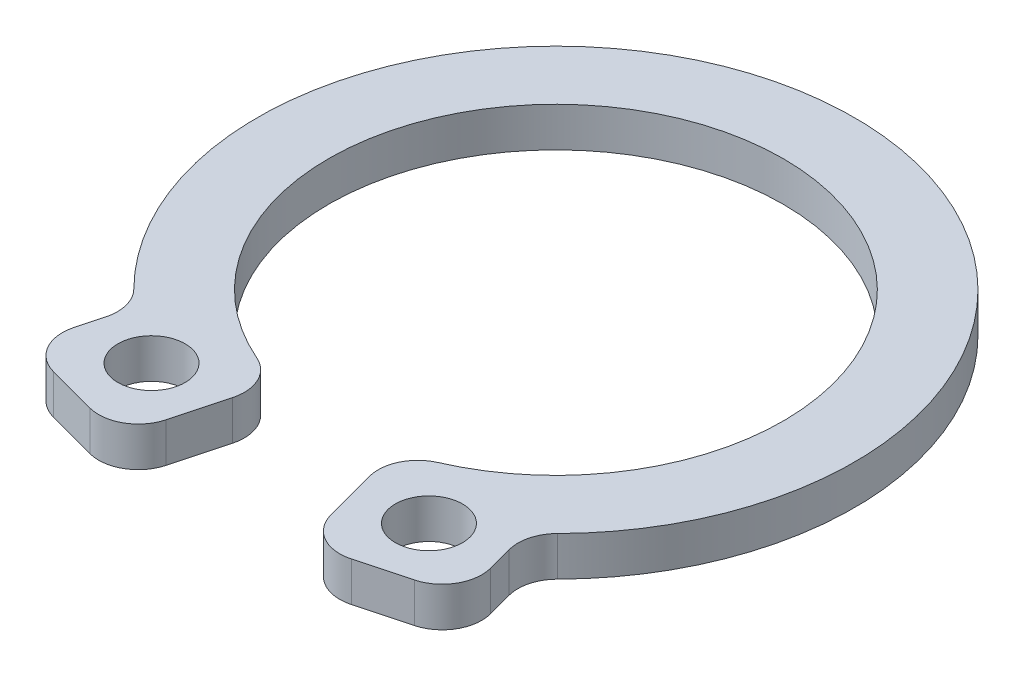
ISO-10303-21;
HEADER;
FILE_DESCRIPTION(('STEP AP214'),'2;1');
FILE_NAME('part.step','',(''),(''),'','','');
FILE_SCHEMA(('AUTOMOTIVE_DESIGN { 1 0 10303 214 1 1 1 1 }'));
ENDSEC;
DATA;
#1=APPLICATION_CONTEXT('core data for automotive mechanical design processes');
#2=APPLICATION_PROTOCOL_DEFINITION('international standard','automotive_design',2000,#1);
#3=PRODUCT_CONTEXT('',#1,'mechanical');
#4=PRODUCT('Part','Part','',(#3));
#5=PRODUCT_RELATED_PRODUCT_CATEGORY('part','',(#4));
#6=PRODUCT_DEFINITION_FORMATION('','',#4);
#7=PRODUCT_DEFINITION_CONTEXT('part definition',#1,'design');
#8=PRODUCT_DEFINITION('design','',#6,#7);
#9=PRODUCT_DEFINITION_SHAPE('','',#8);
#10=(LENGTH_UNIT() NAMED_UNIT(*) SI_UNIT(.MILLI.,.METRE.));
#11=(NAMED_UNIT(*) PLANE_ANGLE_UNIT() SI_UNIT($,.RADIAN.));
#12=(NAMED_UNIT(*) SI_UNIT($,.STERADIAN.) SOLID_ANGLE_UNIT());
#13=UNCERTAINTY_MEASURE_WITH_UNIT(LENGTH_MEASURE(1.E-05),#10,'distance_accuracy_value','');
#14=(GEOMETRIC_REPRESENTATION_CONTEXT(3) GLOBAL_UNCERTAINTY_ASSIGNED_CONTEXT((#13)) GLOBAL_UNIT_ASSIGNED_CONTEXT((#10,
#11,#12)) REPRESENTATION_CONTEXT('',''));
#15=CARTESIAN_POINT('',(0.,0.,0.));
#16=DIRECTION('',(0.,0.,1.));
#17=DIRECTION('',(1.,0.,0.));
#18=AXIS2_PLACEMENT_3D('',#15,#16,#17);
#19=CARTESIAN_POINT('',(3.18755522675393,1.,-0.85410284883832));
#20=DIRECTION('',(-0.965925826289068,0.,0.258819045102521));
#21=DIRECTION('',(0.258819045102521,0.,0.965925826289068));
#22=AXIS2_PLACEMENT_3D('',#19,#20,#21);
#23=PLANE('',#22);
#24=DIRECTION('',(-0.258819045102521,0.,-0.965925826289068));
#25=VECTOR('',#24,1.);
#26=CARTESIAN_POINT('',(3.18755522675393,1.,-0.85410284883832));
#27=LINE('',#26,#25);
#28=CARTESIAN_POINT('',(5.27104853982922,1.,6.92160005278868));
#29=VERTEX_POINT('',#28);
#30=CARTESIAN_POINT('',(5.1002349746237,1.,6.2841151488197));
#31=VERTEX_POINT('',#30);
#32=EDGE_CURVE('E259',#29,#31,#27,.T.);
#33=ORIENTED_EDGE('',*,*,#32,.F.);
#34=DIRECTION('',(0.,-1.,0.));
#35=VECTOR('',#34,1.);
#36=CARTESIAN_POINT('',(5.27104853982922,1.,6.92160005278868));
#37=LINE('',#36,#35);
#38=CARTESIAN_POINT('',(5.27104853982922,0.,6.92160005278868));
#39=VERTEX_POINT('',#38);
#40=EDGE_CURVE('E191',#29,#39,#37,.T.);
#41=ORIENTED_EDGE('',*,*,#40,.T.);
#42=DIRECTION('',(-0.258819045102521,0.,-0.965925826289068));
#43=VECTOR('',#42,1.);
#44=CARTESIAN_POINT('',(3.18755522675393,0.,-0.85410284883832));
#45=LINE('',#44,#43);
#46=CARTESIAN_POINT('',(5.1002349746237,0.,6.2841151488197));
#47=VERTEX_POINT('',#46);
#48=EDGE_CURVE('E240',#39,#47,#45,.T.);
#49=ORIENTED_EDGE('',*,*,#48,.T.);
#50=DIRECTION('',(0.,1.,0.));
#51=VECTOR('',#50,1.);
#52=CARTESIAN_POINT('',(5.1002349746237,1.,6.2841151488197));
#53=LINE('',#52,#51);
#54=EDGE_CURVE('E189',#47,#31,#53,.T.);
#55=ORIENTED_EDGE('',*,*,#54,.T.);
#56=EDGE_LOOP('',(#33,#41,#49,#55));
#57=FACE_BOUND('',#56,.T.);
#58=ADVANCED_FACE('F32',(#57),#23,.F.);
#59=CARTESIAN_POINT('',(0.,1.,0.));
#60=DIRECTION('',(0.,-1.,0.));
#61=DIRECTION('',(0.,0.,-1.));
#62=AXIS2_PLACEMENT_3D('',#59,#60,#61);
#63=CYLINDRICAL_SURFACE('',#62,7.55);
#64=CARTESIAN_POINT('',(0.,0.,0.));
#65=DIRECTION('',(0.,1.,0.));
#66=DIRECTION('',(0.,0.,1.));
#67=AXIS2_PLACEMENT_3D('',#64,#65,#66);
#68=CIRCLE('',#67,7.55);
#69=CARTESIAN_POINT('',(5.35666830957794,0.,5.32058310913037));
#70=VERTEX_POINT('',#69);
#71=CARTESIAN_POINT('',(-5.35666830957794,0.,5.32058310913037));
#72=VERTEX_POINT('',#71);
#73=EDGE_CURVE('E169',#70,#72,#68,.T.);
#74=ORIENTED_EDGE('',*,*,#73,.T.);
#75=DIRECTION('',(0.,-1.,0.));
#76=VECTOR('',#75,1.);
#77=CARTESIAN_POINT('',(-5.35666830957794,1.,5.32058310913037));
#78=LINE('',#77,#76);
#79=CARTESIAN_POINT('',(-5.35666830957794,1.,5.32058310913037));
#80=VERTEX_POINT('',#79);
#81=EDGE_CURVE('E187',#72,#80,#78,.F.);
#82=ORIENTED_EDGE('',*,*,#81,.T.);
#83=CARTESIAN_POINT('',(0.,1.,0.));
#84=DIRECTION('',(0.,1.,0.));
#85=DIRECTION('',(0.,0.,1.));
#86=AXIS2_PLACEMENT_3D('',#83,#84,#85);
#87=CIRCLE('',#86,7.55);
#88=CARTESIAN_POINT('',(5.35666830957794,1.,5.32058310913037));
#89=VERTEX_POINT('',#88);
#90=EDGE_CURVE('E257',#89,#80,#87,.T.);
#91=ORIENTED_EDGE('',*,*,#90,.F.);
#92=DIRECTION('',(0.,-1.,0.));
#93=VECTOR('',#92,1.);
#94=CARTESIAN_POINT('',(5.35666830957794,1.,5.32058310913037));
#95=LINE('',#94,#93);
#96=EDGE_CURVE('E176',#89,#70,#95,.T.);
#97=ORIENTED_EDGE('',*,*,#96,.T.);
#98=EDGE_LOOP('',(#74,#82,#91,#97));
#99=FACE_BOUND('',#98,.T.);
#100=ADVANCED_FACE('F261',(#99),#63,.T.);
#101=CARTESIAN_POINT('',(-3.18755522675393,1.,-0.85410284883832));
#102=DIRECTION('',(-0.965925826289068,0.,-0.258819045102521));
#103=DIRECTION('',(-0.258819045102521,0.,0.965925826289068));
#104=AXIS2_PLACEMENT_3D('',#101,#102,#103);
#105=PLANE('',#104);
#106=DIRECTION('',(0.258819045102521,0.,-0.965925826289068));
#107=VECTOR('',#106,1.);
#108=CARTESIAN_POINT('',(-3.18755522675393,1.,-0.85410284883832));
#109=LINE('',#108,#107);
#110=CARTESIAN_POINT('',(-5.27104853982922,1.,6.92160005278868));
#111=VERTEX_POINT('',#110);
#112=CARTESIAN_POINT('',(-5.1002349746237,1.,6.2841151488197));
#113=VERTEX_POINT('',#112);
#114=EDGE_CURVE('E263',#111,#113,#109,.T.);
#115=ORIENTED_EDGE('',*,*,#114,.T.);
#116=DIRECTION('',(0.,-1.,0.));
#117=VECTOR('',#116,1.);
#118=CARTESIAN_POINT('',(-5.1002349746237,1.,6.2841151488197));
#119=LINE('',#118,#117);
#120=CARTESIAN_POINT('',(-5.1002349746237,0.,6.2841151488197));
#121=VERTEX_POINT('',#120);
#122=EDGE_CURVE('E168',#113,#121,#119,.T.);
#123=ORIENTED_EDGE('',*,*,#122,.T.);
#124=DIRECTION('',(0.258819045102521,0.,-0.965925826289068));
#125=VECTOR('',#124,1.);
#126=CARTESIAN_POINT('',(-3.18755522675393,0.,-0.85410284883832));
#127=LINE('',#126,#125);
#128=CARTESIAN_POINT('',(-5.27104853982922,0.,6.92160005278868));
#129=VERTEX_POINT('',#128);
#130=EDGE_CURVE('E151',#129,#121,#127,.T.);
#131=ORIENTED_EDGE('',*,*,#130,.F.);
#132=DIRECTION('',(0.,-1.,0.));
#133=VECTOR('',#132,1.);
#134=CARTESIAN_POINT('',(-5.27104853982922,1.,6.92160005278868));
#135=LINE('',#134,#133);
#136=EDGE_CURVE('E165',#129,#111,#135,.F.);
#137=ORIENTED_EDGE('',*,*,#136,.T.);
#138=EDGE_LOOP('',(#115,#123,#131,#137));
#139=FACE_BOUND('',#138,.T.);
#140=ADVANCED_FACE('F164',(#139),#105,.T.);
#141=CARTESIAN_POINT('',(-2.34231235817782,1.,8.74162872791607));
#142=DIRECTION('',(-0.258819045102521,0.,0.965925826289068));
#143=DIRECTION('',(0.965925826289068,0.,0.258819045102521));
#144=AXIS2_PLACEMENT_3D('',#141,#142,#143);
#145=PLANE('',#144);
#146=DIRECTION('',(-0.965925826289068,0.,-0.258819045102521));
#147=VECTOR('',#146,1.);
#148=CARTESIAN_POINT('',(-2.34231235817782,1.,8.74162872791607));
#149=LINE('',#148,#147);
#150=CARTESIAN_POINT('',(-3.30823818446689,1.,8.48280968281355));
#151=VERTEX_POINT('',#150);
#152=CARTESIAN_POINT('',(-4.56394175864267,1.,8.14634492418027));
#153=VERTEX_POINT('',#152);
#154=EDGE_CURVE('E265',#151,#153,#149,.T.);
#155=ORIENTED_EDGE('',*,*,#154,.T.);
#156=DIRECTION('',(0.,-1.,0.));
#157=VECTOR('',#156,1.);
#158=CARTESIAN_POINT('',(-4.56394175864267,1.,8.14634492418027));
#159=LINE('',#158,#157);
#160=CARTESIAN_POINT('',(-4.56394175864267,0.,8.14634492418027));
#161=VERTEX_POINT('',#160);
#162=EDGE_CURVE('E233',#153,#161,#159,.T.);
#163=ORIENTED_EDGE('',*,*,#162,.T.);
#164=DIRECTION('',(-0.965925826289068,0.,-0.258819045102521));
#165=VECTOR('',#164,1.);
#166=CARTESIAN_POINT('',(-2.34231235817782,0.,8.74162872791607));
#167=LINE('',#166,#165);
#168=CARTESIAN_POINT('',(-3.30823818446689,0.,8.48280968281355));
#169=VERTEX_POINT('',#168);
#170=EDGE_CURVE('E153',#169,#161,#167,.T.);
#171=ORIENTED_EDGE('',*,*,#170,.F.);
#172=DIRECTION('',(0.,-1.,0.));
#173=VECTOR('',#172,1.);
#174=CARTESIAN_POINT('',(-3.30823818446689,1.,8.48280968281355));
#175=LINE('',#174,#173);
#176=EDGE_CURVE('E231',#169,#151,#175,.F.);
#177=ORIENTED_EDGE('',*,*,#176,.T.);
#178=EDGE_LOOP('',(#155,#163,#171,#177));
#179=FACE_BOUND('',#178,.T.);
#180=ADVANCED_FACE('F389',(#179),#145,.T.);
#181=CARTESIAN_POINT('',(0.,1.,0.));
#182=DIRECTION('',(0.965925826289068,0.,0.258819045102521));
#183=DIRECTION('',(0.258819045102521,0.,-0.965925826289068));
#184=AXIS2_PLACEMENT_3D('',#181,#182,#183);
#185=PLANE('',#184);
#186=DIRECTION('',(-0.258819045102521,0.,0.965925826289068));
#187=VECTOR('',#186,1.);
#188=CARTESIAN_POINT('',(0.,0.,0.));
#189=LINE('',#188,#187);
#190=CARTESIAN_POINT('',(-1.72775040787956,0.,6.44805230500436));
#191=VERTEX_POINT('',#190);
#192=CARTESIAN_POINT('',(-2.0834933130753,0.,7.775702901627));
#193=VERTEX_POINT('',#192);
#194=EDGE_CURVE('E285',#191,#193,#189,.T.);
#195=ORIENTED_EDGE('',*,*,#194,.F.);
#196=DIRECTION('',(0.,-1.,0.));
#197=VECTOR('',#196,1.);
#198=CARTESIAN_POINT('',(-1.72775040787956,1.,6.44805230500436));
#199=LINE('',#198,#197);
#200=CARTESIAN_POINT('',(-1.72775040787956,1.,6.44805230500436));
#201=VERTEX_POINT('',#200);
#202=EDGE_CURVE('E229',#191,#201,#199,.F.);
#203=ORIENTED_EDGE('',*,*,#202,.T.);
#204=DIRECTION('',(-0.258819045102521,0.,0.965925826289068));
#205=VECTOR('',#204,1.);
#206=CARTESIAN_POINT('',(0.,1.,0.));
#207=LINE('',#206,#205);
#208=CARTESIAN_POINT('',(-2.0834933130753,1.,7.775702901627));
#209=VERTEX_POINT('',#208);
#210=EDGE_CURVE('E271',#201,#209,#207,.T.);
#211=ORIENTED_EDGE('',*,*,#210,.T.);
#212=DIRECTION('',(0.,-1.,0.));
#213=VECTOR('',#212,1.);
#214=CARTESIAN_POINT('',(-2.0834933130753,1.,7.775702901627));
#215=LINE('',#214,#213);
#216=EDGE_CURVE('E226',#209,#193,#215,.T.);
#217=ORIENTED_EDGE('',*,*,#216,.T.);
#218=EDGE_LOOP('',(#195,#203,#211,#217));
#219=FACE_BOUND('',#218,.T.);
#220=ADVANCED_FACE('F354',(#219),#185,.T.);
#221=CARTESIAN_POINT('',(0.,1.,0.));
#222=DIRECTION('',(0.,-1.,0.));
#223=DIRECTION('',(0.,0.,-1.));
#224=AXIS2_PLACEMENT_3D('',#221,#222,#223);
#225=CYLINDRICAL_SURFACE('',#224,5.75);
#226=CARTESIAN_POINT('',(0.,0.,0.));
#227=DIRECTION('',(0.,1.,0.));
#228=DIRECTION('',(0.,0.,1.));
#229=AXIS2_PLACEMENT_3D('',#226,#227,#228);
#230=CIRCLE('',#229,5.75);
#231=CARTESIAN_POINT('',(2.29461308836587,0.,5.27230981399045));
#232=VERTEX_POINT('',#231);
#233=CARTESIAN_POINT('',(-2.29461308836587,0.,5.27230981399045));
#234=VERTEX_POINT('',#233);
#235=EDGE_CURVE('E288',#232,#234,#230,.T.);
#236=ORIENTED_EDGE('',*,*,#235,.F.);
#237=DIRECTION('',(0.,-1.,0.));
#238=VECTOR('',#237,1.);
#239=CARTESIAN_POINT('',(2.29461308836587,1.,5.27230981399045));
#240=LINE('',#239,#238);
#241=CARTESIAN_POINT('',(2.29461308836587,1.,5.27230981399045));
#242=VERTEX_POINT('',#241);
#243=EDGE_CURVE('E224',#232,#242,#240,.F.);
#244=ORIENTED_EDGE('',*,*,#243,.T.);
#245=CARTESIAN_POINT('',(0.,1.,0.));
#246=DIRECTION('',(0.,1.,0.));
#247=DIRECTION('',(0.,0.,1.));
#248=AXIS2_PLACEMENT_3D('',#245,#246,#247);
#249=CIRCLE('',#248,5.75);
#250=CARTESIAN_POINT('',(-2.29461308836587,1.,5.27230981399045));
#251=VERTEX_POINT('',#250);
#252=EDGE_CURVE('E274',#242,#251,#249,.T.);
#253=ORIENTED_EDGE('',*,*,#252,.T.);
#254=DIRECTION('',(0.,-1.,0.));
#255=VECTOR('',#254,1.);
#256=CARTESIAN_POINT('',(-2.29461308836587,1.,5.27230981399045));
#257=LINE('',#256,#255);
#258=EDGE_CURVE('E221',#251,#234,#257,.T.);
#259=ORIENTED_EDGE('',*,*,#258,.T.);
#260=EDGE_LOOP('',(#236,#244,#253,#259));
#261=FACE_BOUND('',#260,.T.);
#262=ADVANCED_FACE('F359',(#261),#225,.F.);
#263=CARTESIAN_POINT('',(0.,1.,0.));
#264=DIRECTION('',(0.965925826289068,0.,-0.258819045102521));
#265=DIRECTION('',(-0.258819045102521,0.,-0.965925826289068));
#266=AXIS2_PLACEMENT_3D('',#263,#264,#265);
#267=PLANE('',#266);
#268=DIRECTION('',(0.258819045102521,0.,0.965925826289068));
#269=VECTOR('',#268,1.);
#270=CARTESIAN_POINT('',(0.,1.,0.));
#271=LINE('',#270,#269);
#272=CARTESIAN_POINT('',(1.72775040787956,1.,6.44805230500436));
#273=VERTEX_POINT('',#272);
#274=CARTESIAN_POINT('',(2.0834933130753,1.,7.775702901627));
#275=VERTEX_POINT('',#274);
#276=EDGE_CURVE('E277',#273,#275,#271,.T.);
#277=ORIENTED_EDGE('',*,*,#276,.F.);
#278=DIRECTION('',(0.,1.,0.));
#279=VECTOR('',#278,1.);
#280=CARTESIAN_POINT('',(1.72775040787956,0.,6.44805230500436));
#281=LINE('',#280,#279);
#282=CARTESIAN_POINT('',(1.72775040787956,0.,6.44805230500436));
#283=VERTEX_POINT('',#282);
#284=EDGE_CURVE('E218',#273,#283,#281,.F.);
#285=ORIENTED_EDGE('',*,*,#284,.T.);
#286=DIRECTION('',(0.258819045102521,0.,0.965925826289068));
#287=VECTOR('',#286,1.);
#288=CARTESIAN_POINT('',(0.,0.,0.));
#289=LINE('',#288,#287);
#290=CARTESIAN_POINT('',(2.0834933130753,0.,7.775702901627));
#291=VERTEX_POINT('',#290);
#292=EDGE_CURVE('E291',#283,#291,#289,.T.);
#293=ORIENTED_EDGE('',*,*,#292,.T.);
#294=DIRECTION('',(0.,-1.,0.));
#295=VECTOR('',#294,1.);
#296=CARTESIAN_POINT('',(2.0834933130753,1.,7.775702901627));
#297=LINE('',#296,#295);
#298=EDGE_CURVE('E47',#291,#275,#297,.F.);
#299=ORIENTED_EDGE('',*,*,#298,.T.);
#300=EDGE_LOOP('',(#277,#285,#293,#299));
#301=FACE_BOUND('',#300,.T.);
#302=ADVANCED_FACE('F363',(#301),#267,.F.);
#303=CARTESIAN_POINT('',(-3.50903854713562,1.,6.72079969011994));
#304=DIRECTION('',(0.,-1.,0.));
#305=DIRECTION('',(0.,0.,-1.));
#306=AXIS2_PLACEMENT_3D('',#303,#304,#305);
#307=CYLINDRICAL_SURFACE('',#306,0.85);
#308=CARTESIAN_POINT('',(-3.50903854713562,1.,6.72079969011994));
#309=DIRECTION('',(0.,1.,0.));
#310=DIRECTION('',(0.,0.,1.));
#311=AXIS2_PLACEMENT_3D('',#308,#309,#310);
#312=CIRCLE('',#311,0.85);
#313=CARTESIAN_POINT('',(-3.50903854713562,1.,7.57079969011995));
#314=VERTEX_POINT('',#313);
#315=EDGE_CURVE('E179',#314,#314,#312,.T.);
#316=ORIENTED_EDGE('',*,*,#315,.T.);
#317=EDGE_LOOP('',(#316));
#318=FACE_BOUND('',#317,.T.);
#319=CARTESIAN_POINT('',(-3.50903854713562,0.,6.72079969011994));
#320=DIRECTION('',(0.,1.,0.));
#321=DIRECTION('',(0.,0.,1.));
#322=AXIS2_PLACEMENT_3D('',#319,#320,#321);
#323=CIRCLE('',#322,0.85);
#324=CARTESIAN_POINT('',(-3.50903854713562,0.,7.57079969011995));
#325=VERTEX_POINT('',#324);
#326=EDGE_CURVE('E295',#325,#325,#323,.T.);
#327=ORIENTED_EDGE('',*,*,#326,.F.);
#328=EDGE_LOOP('',(#327));
#329=FACE_BOUND('',#328,.T.);
#330=ADVANCED_FACE('F373',(#318,#329),#307,.F.);
#331=CARTESIAN_POINT('',(2.34231235817782,1.,8.74162872791607));
#332=DIRECTION('',(-0.258819045102521,0.,-0.965925826289068));
#333=DIRECTION('',(-0.965925826289068,0.,0.258819045102521));
#334=AXIS2_PLACEMENT_3D('',#331,#332,#333);
#335=PLANE('',#334);
#336=DIRECTION('',(0.965925826289068,0.,-0.258819045102521));
#337=VECTOR('',#336,1.);
#338=CARTESIAN_POINT('',(2.34231235817782,0.,8.74162872791607));
#339=LINE('',#338,#337);
#340=CARTESIAN_POINT('',(3.30823818446689,0.,8.48280968281355));
#341=VERTEX_POINT('',#340);
#342=CARTESIAN_POINT('',(4.56394175864267,0.,8.14634492418027));
#343=VERTEX_POINT('',#342);
#344=EDGE_CURVE('E293',#341,#343,#339,.T.);
#345=ORIENTED_EDGE('',*,*,#344,.T.);
#346=DIRECTION('',(0.,-1.,0.));
#347=VECTOR('',#346,1.);
#348=CARTESIAN_POINT('',(4.56394175864267,1.,8.14634492418027));
#349=LINE('',#348,#347);
#350=CARTESIAN_POINT('',(4.56394175864267,1.,8.14634492418027));
#351=VERTEX_POINT('',#350);
#352=EDGE_CURVE('E205',#343,#351,#349,.F.);
#353=ORIENTED_EDGE('',*,*,#352,.T.);
#354=DIRECTION('',(0.965925826289068,0.,-0.258819045102521));
#355=VECTOR('',#354,1.);
#356=CARTESIAN_POINT('',(2.34231235817782,1.,8.74162872791607));
#357=LINE('',#356,#355);
#358=CARTESIAN_POINT('',(3.30823818446689,1.,8.48280968281355));
#359=VERTEX_POINT('',#358);
#360=EDGE_CURVE('E279',#359,#351,#357,.T.);
#361=ORIENTED_EDGE('',*,*,#360,.F.);
#362=DIRECTION('',(0.,-1.,0.));
#363=VECTOR('',#362,1.);
#364=CARTESIAN_POINT('',(3.30823818446689,1.,8.48280968281355));
#365=LINE('',#364,#363);
#366=EDGE_CURVE('E202',#359,#341,#365,.T.);
#367=ORIENTED_EDGE('',*,*,#366,.T.);
#368=EDGE_LOOP('',(#345,#353,#361,#367));
#369=FACE_BOUND('',#368,.T.);
#370=ADVANCED_FACE('F369',(#369),#335,.F.);
#371=CARTESIAN_POINT('',(3.50903854713562,1.,6.72079969011994));
#372=DIRECTION('',(0.,-1.,0.));
#373=DIRECTION('',(0.,0.,-1.));
#374=AXIS2_PLACEMENT_3D('',#371,#372,#373);
#375=CYLINDRICAL_SURFACE('',#374,0.85);
#376=CARTESIAN_POINT('',(3.50903854713562,1.,6.72079969011994));
#377=DIRECTION('',(0.,1.,0.));
#378=DIRECTION('',(0.,0.,1.));
#379=AXIS2_PLACEMENT_3D('',#376,#377,#378);
#380=CIRCLE('',#379,0.85);
#381=CARTESIAN_POINT('',(3.50903854713562,1.,7.57079969011995));
#382=VERTEX_POINT('',#381);
#383=EDGE_CURVE('E174',#382,#382,#380,.F.);
#384=ORIENTED_EDGE('',*,*,#383,.F.);
#385=EDGE_LOOP('',(#384));
#386=FACE_BOUND('',#385,.T.);
#387=CARTESIAN_POINT('',(3.50903854713562,0.,6.72079969011994));
#388=DIRECTION('',(0.,1.,0.));
#389=DIRECTION('',(0.,0.,1.));
#390=AXIS2_PLACEMENT_3D('',#387,#388,#389);
#391=CIRCLE('',#390,0.85);
#392=CARTESIAN_POINT('',(3.50903854713562,0.,7.57079969011995));
#393=VERTEX_POINT('',#392);
#394=EDGE_CURVE('E182',#393,#393,#391,.F.);
#395=ORIENTED_EDGE('',*,*,#394,.T.);
#396=EDGE_LOOP('',(#395));
#397=FACE_BOUND('',#396,.T.);
#398=ADVANCED_FACE('F301',(#386,#397),#375,.F.);
#399=CARTESIAN_POINT('',(0.,1.,0.));
#400=DIRECTION('',(0.,1.,0.));
#401=DIRECTION('',(0.,0.,1.));
#402=AXIS2_PLACEMENT_3D('',#399,#400,#401);
#403=PLANE('',#402);
#404=ORIENTED_EDGE('',*,*,#360,.T.);
#405=CARTESIAN_POINT('',(4.30512271354015,1.,7.1804190978912));
#406=DIRECTION('',(0.,1.,0.));
#407=DIRECTION('',(0.,0.,1.));
#408=AXIS2_PLACEMENT_3D('',#405,#406,#407);
#409=CIRCLE('',#408,1.);
#410=EDGE_CURVE('E215',#351,#29,#409,.T.);
#411=ORIENTED_EDGE('',*,*,#410,.T.);
#412=ORIENTED_EDGE('',*,*,#32,.T.);
#413=CARTESIAN_POINT('',(6.06616080091277,1.,6.02529610371718));
#414=DIRECTION('',(0.,1.,0.));
#415=DIRECTION('',(0.,0.,1.));
#416=AXIS2_PLACEMENT_3D('',#413,#414,#415);
#417=CIRCLE('',#416,1.);
#418=EDGE_CURVE('E11',#31,#89,#417,.F.);
#419=ORIENTED_EDGE('',*,*,#418,.T.);
#420=ORIENTED_EDGE('',*,*,#90,.T.);
#421=CARTESIAN_POINT('',(-6.06616080091277,1.,6.02529610371718));
#422=DIRECTION('',(0.,1.,0.));
#423=DIRECTION('',(0.,0.,1.));
#424=AXIS2_PLACEMENT_3D('',#421,#422,#423);
#425=CIRCLE('',#424,1.);
#426=EDGE_CURVE('E237',#80,#113,#425,.F.);
#427=ORIENTED_EDGE('',*,*,#426,.T.);
#428=ORIENTED_EDGE('',*,*,#114,.F.);
#429=CARTESIAN_POINT('',(-4.30512271354015,1.,7.1804190978912));
#430=DIRECTION('',(0.,1.,0.));
#431=DIRECTION('',(0.,0.,1.));
#432=AXIS2_PLACEMENT_3D('',#429,#430,#431);
#433=CIRCLE('',#432,1.);
#434=EDGE_CURVE('E173',#111,#153,#433,.T.);
#435=ORIENTED_EDGE('',*,*,#434,.T.);
#436=ORIENTED_EDGE('',*,*,#154,.F.);
#437=CARTESIAN_POINT('',(-3.04941913936436,1.,7.51688385652448));
#438=DIRECTION('',(0.,1.,0.));
#439=DIRECTION('',(0.,0.,1.));
#440=AXIS2_PLACEMENT_3D('',#437,#438,#439);
#441=CIRCLE('',#440,1.);
#442=EDGE_CURVE('E207',#151,#209,#441,.T.);
#443=ORIENTED_EDGE('',*,*,#442,.T.);
#444=ORIENTED_EDGE('',*,*,#210,.F.);
#445=CARTESIAN_POINT('',(-2.69367623416863,1.,6.18923325990184));
#446=DIRECTION('',(0.,1.,0.));
#447=DIRECTION('',(0.,0.,1.));
#448=AXIS2_PLACEMENT_3D('',#445,#446,#447);
#449=CIRCLE('',#448,1.);
#450=EDGE_CURVE('E210',#201,#251,#449,.T.);
#451=ORIENTED_EDGE('',*,*,#450,.T.);
#452=ORIENTED_EDGE('',*,*,#252,.F.);
#453=CARTESIAN_POINT('',(2.69367623416863,1.,6.18923325990184));
#454=DIRECTION('',(0.,1.,0.));
#455=DIRECTION('',(0.,0.,1.));
#456=AXIS2_PLACEMENT_3D('',#453,#454,#455);
#457=CIRCLE('',#456,1.);
#458=EDGE_CURVE('E54',#242,#273,#457,.T.);
#459=ORIENTED_EDGE('',*,*,#458,.T.);
#460=ORIENTED_EDGE('',*,*,#276,.T.);
#461=CARTESIAN_POINT('',(3.04941913936436,1.,7.51688385652448));
#462=DIRECTION('',(0.,1.,0.));
#463=DIRECTION('',(0.,0.,1.));
#464=AXIS2_PLACEMENT_3D('',#461,#462,#463);
#465=CIRCLE('',#464,1.);
#466=EDGE_CURVE('E212',#275,#359,#465,.T.);
#467=ORIENTED_EDGE('',*,*,#466,.T.);
#468=EDGE_LOOP('',(#404,#411,#412,#419,#420,#427,#428,#435,#436,#443,#444,#451,#452,#459,#460,#467));
#469=FACE_BOUND('',#468,.T.);
#470=ORIENTED_EDGE('',*,*,#315,.F.);
#471=EDGE_LOOP('',(#470));
#472=FACE_BOUND('',#471,.T.);
#473=ORIENTED_EDGE('',*,*,#383,.T.);
#474=EDGE_LOOP('',(#473));
#475=FACE_BOUND('',#474,.T.);
#476=ADVANCED_FACE('F255',(#469,#472,#475),#403,.T.);
#477=CARTESIAN_POINT('',(0.,0.,0.));
#478=DIRECTION('',(0.,1.,0.));
#479=DIRECTION('',(0.,0.,1.));
#480=AXIS2_PLACEMENT_3D('',#477,#478,#479);
#481=PLANE('',#480);
#482=ORIENTED_EDGE('',*,*,#48,.F.);
#483=CARTESIAN_POINT('',(4.30512271354015,0.,7.1804190978912));
#484=DIRECTION('',(0.,1.,0.));
#485=DIRECTION('',(0.,0.,1.));
#486=AXIS2_PLACEMENT_3D('',#483,#484,#485);
#487=CIRCLE('',#486,1.);
#488=EDGE_CURVE('E200',#39,#343,#487,.F.);
#489=ORIENTED_EDGE('',*,*,#488,.T.);
#490=ORIENTED_EDGE('',*,*,#344,.F.);
#491=CARTESIAN_POINT('',(3.04941913936436,0.,7.51688385652448));
#492=DIRECTION('',(0.,1.,0.));
#493=DIRECTION('',(0.,0.,1.));
#494=AXIS2_PLACEMENT_3D('',#491,#492,#493);
#495=CIRCLE('',#494,1.);
#496=EDGE_CURVE('E196',#341,#291,#495,.F.);
#497=ORIENTED_EDGE('',*,*,#496,.T.);
#498=ORIENTED_EDGE('',*,*,#292,.F.);
#499=CARTESIAN_POINT('',(2.69367623416863,0.,6.18923325990184));
#500=DIRECTION('',(0.,1.,0.));
#501=DIRECTION('',(0.,0.,1.));
#502=AXIS2_PLACEMENT_3D('',#499,#500,#501);
#503=CIRCLE('',#502,1.);
#504=EDGE_CURVE('E198',#283,#232,#503,.F.);
#505=ORIENTED_EDGE('',*,*,#504,.T.);
#506=ORIENTED_EDGE('',*,*,#235,.T.);
#507=CARTESIAN_POINT('',(-2.69367623416863,0.,6.18923325990184));
#508=DIRECTION('',(0.,1.,0.));
#509=DIRECTION('',(0.,0.,1.));
#510=AXIS2_PLACEMENT_3D('',#507,#508,#509);
#511=CIRCLE('',#510,1.);
#512=EDGE_CURVE('E158',#234,#191,#511,.F.);
#513=ORIENTED_EDGE('',*,*,#512,.T.);
#514=ORIENTED_EDGE('',*,*,#194,.T.);
#515=CARTESIAN_POINT('',(-3.04941913936436,0.,7.51688385652448));
#516=DIRECTION('',(0.,1.,0.));
#517=DIRECTION('',(0.,0.,1.));
#518=AXIS2_PLACEMENT_3D('',#515,#516,#517);
#519=CIRCLE('',#518,1.);
#520=EDGE_CURVE('E159',#193,#169,#519,.F.);
#521=ORIENTED_EDGE('',*,*,#520,.T.);
#522=ORIENTED_EDGE('',*,*,#170,.T.);
#523=CARTESIAN_POINT('',(-4.30512271354015,0.,7.1804190978912));
#524=DIRECTION('',(0.,1.,0.));
#525=DIRECTION('',(0.,0.,1.));
#526=AXIS2_PLACEMENT_3D('',#523,#524,#525);
#527=CIRCLE('',#526,1.);
#528=EDGE_CURVE('E146',#161,#129,#527,.F.);
#529=ORIENTED_EDGE('',*,*,#528,.T.);
#530=ORIENTED_EDGE('',*,*,#130,.T.);
#531=CARTESIAN_POINT('',(-6.06616080091277,0.,6.02529610371718));
#532=DIRECTION('',(0.,1.,0.));
#533=DIRECTION('',(0.,0.,1.));
#534=AXIS2_PLACEMENT_3D('',#531,#532,#533);
#535=CIRCLE('',#534,1.);
#536=EDGE_CURVE('E235',#121,#72,#535,.T.);
#537=ORIENTED_EDGE('',*,*,#536,.T.);
#538=ORIENTED_EDGE('',*,*,#73,.F.);
#539=CARTESIAN_POINT('',(6.06616080091277,0.,6.02529610371718));
#540=DIRECTION('',(0.,1.,0.));
#541=DIRECTION('',(0.,0.,1.));
#542=AXIS2_PLACEMENT_3D('',#539,#540,#541);
#543=CIRCLE('',#542,1.);
#544=EDGE_CURVE('E40',#70,#47,#543,.T.);
#545=ORIENTED_EDGE('',*,*,#544,.T.);
#546=EDGE_LOOP('',(#482,#489,#490,#497,#498,#505,#506,#513,#514,#521,#522,#529,#530,#537,#538,#545));
#547=FACE_BOUND('',#546,.T.);
#548=ORIENTED_EDGE('',*,*,#326,.T.);
#549=EDGE_LOOP('',(#548));
#550=FACE_BOUND('',#549,.T.);
#551=ORIENTED_EDGE('',*,*,#394,.F.);
#552=EDGE_LOOP('',(#551));
#553=FACE_BOUND('',#552,.T.);
#554=ADVANCED_FACE('F149',(#547,#550,#553),#481,.F.);
#555=CARTESIAN_POINT('',(-6.06616080091277,1.,6.02529610371718));
#556=DIRECTION('',(0.,-1.,0.));
#557=DIRECTION('',(0.,0.,-1.));
#558=AXIS2_PLACEMENT_3D('',#555,#556,#557);
#559=CYLINDRICAL_SURFACE('',#558,1.);
#560=ORIENTED_EDGE('',*,*,#426,.F.);
#561=ORIENTED_EDGE('',*,*,#81,.F.);
#562=ORIENTED_EDGE('',*,*,#536,.F.);
#563=ORIENTED_EDGE('',*,*,#122,.F.);
#564=EDGE_LOOP('',(#560,#561,#562,#563));
#565=FACE_BOUND('',#564,.T.);
#566=ADVANCED_FACE('F304',(#565),#559,.F.);
#567=CARTESIAN_POINT('',(4.30512271354015,1.,7.1804190978912));
#568=DIRECTION('',(0.,-1.,0.));
#569=DIRECTION('',(0.,0.,-1.));
#570=AXIS2_PLACEMENT_3D('',#567,#568,#569);
#571=CYLINDRICAL_SURFACE('',#570,1.);
#572=ORIENTED_EDGE('',*,*,#410,.F.);
#573=ORIENTED_EDGE('',*,*,#352,.F.);
#574=ORIENTED_EDGE('',*,*,#488,.F.);
#575=ORIENTED_EDGE('',*,*,#40,.F.);
#576=EDGE_LOOP('',(#572,#573,#574,#575));
#577=FACE_BOUND('',#576,.T.);
#578=ADVANCED_FACE('F310',(#577),#571,.T.);
#579=CARTESIAN_POINT('',(6.06616080091277,1.,6.02529610371718));
#580=DIRECTION('',(0.,-1.,0.));
#581=DIRECTION('',(0.,0.,-1.));
#582=AXIS2_PLACEMENT_3D('',#579,#580,#581);
#583=CYLINDRICAL_SURFACE('',#582,1.);
#584=ORIENTED_EDGE('',*,*,#418,.F.);
#585=ORIENTED_EDGE('',*,*,#54,.F.);
#586=ORIENTED_EDGE('',*,*,#544,.F.);
#587=ORIENTED_EDGE('',*,*,#96,.F.);
#588=EDGE_LOOP('',(#584,#585,#586,#587));
#589=FACE_BOUND('',#588,.T.);
#590=ADVANCED_FACE('F251',(#589),#583,.F.);
#591=CARTESIAN_POINT('',(2.69367623416863,1.,6.18923325990184));
#592=DIRECTION('',(0.,-1.,0.));
#593=DIRECTION('',(0.,0.,-1.));
#594=AXIS2_PLACEMENT_3D('',#591,#592,#593);
#595=CYLINDRICAL_SURFACE('',#594,1.);
#596=ORIENTED_EDGE('',*,*,#458,.F.);
#597=ORIENTED_EDGE('',*,*,#243,.F.);
#598=ORIENTED_EDGE('',*,*,#504,.F.);
#599=ORIENTED_EDGE('',*,*,#284,.F.);
#600=EDGE_LOOP('',(#596,#597,#598,#599));
#601=FACE_BOUND('',#600,.T.);
#602=ADVANCED_FACE('F328',(#601),#595,.T.);
#603=CARTESIAN_POINT('',(3.04941913936436,1.,7.51688385652448));
#604=DIRECTION('',(0.,-1.,0.));
#605=DIRECTION('',(0.,0.,-1.));
#606=AXIS2_PLACEMENT_3D('',#603,#604,#605);
#607=CYLINDRICAL_SURFACE('',#606,1.);
#608=ORIENTED_EDGE('',*,*,#466,.F.);
#609=ORIENTED_EDGE('',*,*,#298,.F.);
#610=ORIENTED_EDGE('',*,*,#496,.F.);
#611=ORIENTED_EDGE('',*,*,#366,.F.);
#612=EDGE_LOOP('',(#608,#609,#610,#611));
#613=FACE_BOUND('',#612,.T.);
#614=ADVANCED_FACE('F331',(#613),#607,.T.);
#615=CARTESIAN_POINT('',(-2.69367623416863,1.,6.18923325990184));
#616=DIRECTION('',(0.,-1.,0.));
#617=DIRECTION('',(0.,0.,-1.));
#618=AXIS2_PLACEMENT_3D('',#615,#616,#617);
#619=CYLINDRICAL_SURFACE('',#618,1.);
#620=ORIENTED_EDGE('',*,*,#450,.F.);
#621=ORIENTED_EDGE('',*,*,#202,.F.);
#622=ORIENTED_EDGE('',*,*,#512,.F.);
#623=ORIENTED_EDGE('',*,*,#258,.F.);
#624=EDGE_LOOP('',(#620,#621,#622,#623));
#625=FACE_BOUND('',#624,.T.);
#626=ADVANCED_FACE('F335',(#625),#619,.T.);
#627=CARTESIAN_POINT('',(-4.30512271354015,1.,7.1804190978912));
#628=DIRECTION('',(0.,-1.,0.));
#629=DIRECTION('',(0.,0.,-1.));
#630=AXIS2_PLACEMENT_3D('',#627,#628,#629);
#631=CYLINDRICAL_SURFACE('',#630,1.);
#632=ORIENTED_EDGE('',*,*,#434,.F.);
#633=ORIENTED_EDGE('',*,*,#136,.F.);
#634=ORIENTED_EDGE('',*,*,#528,.F.);
#635=ORIENTED_EDGE('',*,*,#162,.F.);
#636=EDGE_LOOP('',(#632,#633,#634,#635));
#637=FACE_BOUND('',#636,.T.);
#638=ADVANCED_FACE('F172',(#637),#631,.T.);
#639=CARTESIAN_POINT('',(-3.04941913936436,1.,7.51688385652448));
#640=DIRECTION('',(0.,-1.,0.));
#641=DIRECTION('',(0.,0.,-1.));
#642=AXIS2_PLACEMENT_3D('',#639,#640,#641);
#643=CYLINDRICAL_SURFACE('',#642,1.);
#644=ORIENTED_EDGE('',*,*,#442,.F.);
#645=ORIENTED_EDGE('',*,*,#176,.F.);
#646=ORIENTED_EDGE('',*,*,#520,.F.);
#647=ORIENTED_EDGE('',*,*,#216,.F.);
#648=EDGE_LOOP('',(#644,#645,#646,#647));
#649=FACE_BOUND('',#648,.T.);
#650=ADVANCED_FACE('F34',(#649),#643,.T.);
#651=CLOSED_SHELL('',(#58,#100,#140,#180,#220,#262,#302,#330,#370,#398,#476,#554,#566,#578,#590,
#602,#614,#626,#638,#650));
#652=MANIFOLD_SOLID_BREP('B2',#651);
#653=ADVANCED_BREP_SHAPE_REPRESENTATION('',(#18,#652),#14);
#654=SHAPE_DEFINITION_REPRESENTATION(#9,#653);
ENDSEC;
END-ISO-10303-21;
